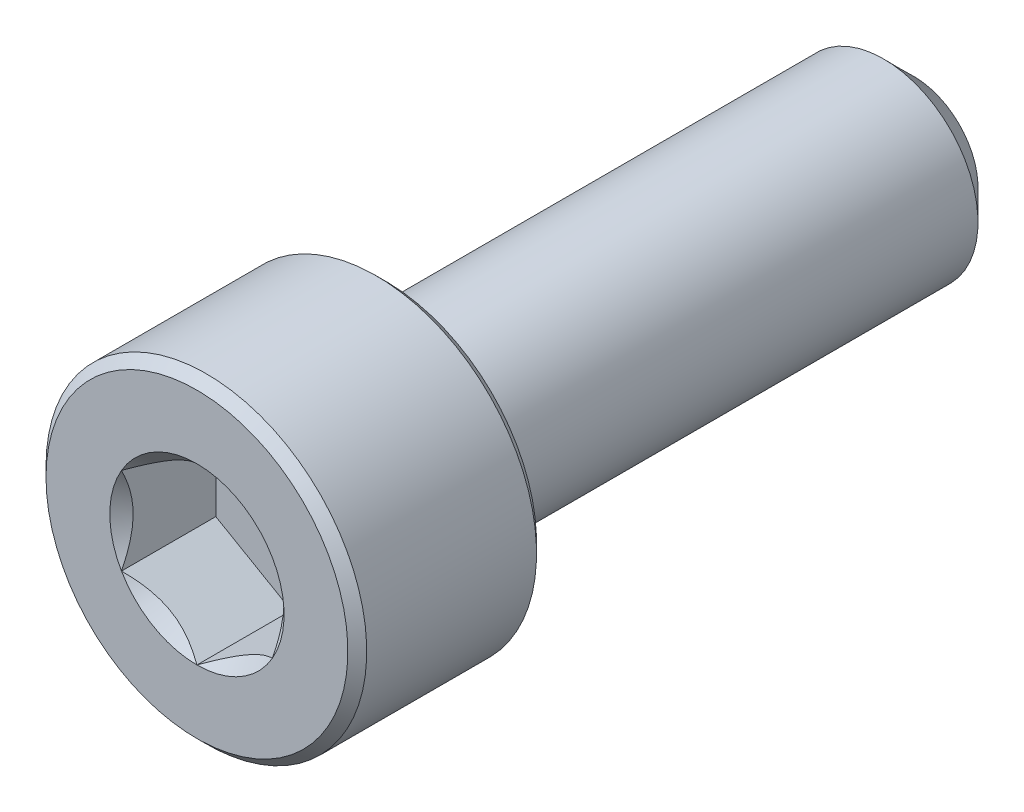
ISO-10303-21;
HEADER;
FILE_DESCRIPTION(('STEP AP214'),'2;1');
FILE_NAME('part.step','',(''),(''),'','','');
FILE_SCHEMA(('AUTOMOTIVE_DESIGN { 1 0 10303 214 1 1 1 1 }'));
ENDSEC;
DATA;
#1=APPLICATION_CONTEXT('core data for automotive mechanical design processes');
#2=APPLICATION_PROTOCOL_DEFINITION('international standard','automotive_design',2000,#1);
#3=PRODUCT_CONTEXT('',#1,'mechanical');
#4=PRODUCT('Part','Part','',(#3));
#5=PRODUCT_RELATED_PRODUCT_CATEGORY('part','',(#4));
#6=PRODUCT_DEFINITION_FORMATION('','',#4);
#7=PRODUCT_DEFINITION_CONTEXT('part definition',#1,'design');
#8=PRODUCT_DEFINITION('design','',#6,#7);
#9=PRODUCT_DEFINITION_SHAPE('','',#8);
#10=(LENGTH_UNIT() NAMED_UNIT(*) SI_UNIT(.MILLI.,.METRE.));
#11=(NAMED_UNIT(*) PLANE_ANGLE_UNIT() SI_UNIT($,.RADIAN.));
#12=(NAMED_UNIT(*) SI_UNIT($,.STERADIAN.) SOLID_ANGLE_UNIT());
#13=UNCERTAINTY_MEASURE_WITH_UNIT(LENGTH_MEASURE(1.E-05),#10,'distance_accuracy_value','');
#14=(GEOMETRIC_REPRESENTATION_CONTEXT(3) GLOBAL_UNCERTAINTY_ASSIGNED_CONTEXT((#13)) GLOBAL_UNIT_ASSIGNED_CONTEXT((#10,
#11,#12)) REPRESENTATION_CONTEXT('',''));
#15=CARTESIAN_POINT('',(0.,0.,0.));
#16=DIRECTION('',(0.,0.,1.));
#17=DIRECTION('',(1.,0.,0.));
#18=AXIS2_PLACEMENT_3D('',#15,#16,#17);
#19=CARTESIAN_POINT('',(0.,4.,9.5));
#20=DIRECTION('',(0.,0.,1.));
#21=DIRECTION('',(1.,0.,0.));
#22=AXIS2_PLACEMENT_3D('',#19,#20,#21);
#23=PLANE('',#22);
#24=CARTESIAN_POINT('',(0.,0.,9.5));
#25=DIRECTION('',(0.,0.,1.));
#26=DIRECTION('',(1.,0.,0.));
#27=AXIS2_PLACEMENT_3D('',#24,#25,#26);
#28=CIRCLE('',#27,2.3094010767585);
#29=CARTESIAN_POINT('',(2.,1.15470053837925,9.5));
#30=VERTEX_POINT('',#29);
#31=CARTESIAN_POINT('',(0.,2.3094010767585,9.5));
#32=VERTEX_POINT('',#31);
#33=EDGE_CURVE('E92',#30,#32,#28,.T.);
#34=ORIENTED_EDGE('',*,*,#33,.F.);
#35=CARTESIAN_POINT('',(2.,-1.15470053837925,9.5));
#36=VERTEX_POINT('',#35);
#37=EDGE_CURVE('E52',#36,#30,#28,.T.);
#38=ORIENTED_EDGE('',*,*,#37,.F.);
#39=CARTESIAN_POINT('',(0.,-2.3094010767585,9.5));
#40=VERTEX_POINT('',#39);
#41=EDGE_CURVE('E278',#40,#36,#28,.T.);
#42=ORIENTED_EDGE('',*,*,#41,.F.);
#43=CARTESIAN_POINT('',(-2.,-1.15470053837925,9.5));
#44=VERTEX_POINT('',#43);
#45=EDGE_CURVE('E59',#44,#40,#28,.T.);
#46=ORIENTED_EDGE('',*,*,#45,.F.);
#47=CARTESIAN_POINT('',(-2.,1.15470053837925,9.5));
#48=VERTEX_POINT('',#47);
#49=EDGE_CURVE('E128',#48,#44,#28,.T.);
#50=ORIENTED_EDGE('',*,*,#49,.F.);
#51=EDGE_CURVE('E101',#32,#48,#28,.T.);
#52=ORIENTED_EDGE('',*,*,#51,.F.);
#53=EDGE_LOOP('',(#34,#38,#42,#46,#50,#52));
#54=FACE_BOUND('',#53,.T.);
#55=CARTESIAN_POINT('',(0.,0.,9.5));
#56=DIRECTION('',(0.,0.,-1.));
#57=DIRECTION('',(-1.,0.,0.));
#58=AXIS2_PLACEMENT_3D('',#55,#56,#57);
#59=CIRCLE('',#58,4.);
#60=CARTESIAN_POINT('',(-4.,0.,9.5));
#61=VERTEX_POINT('',#60);
#62=EDGE_CURVE('E46',#61,#61,#59,.T.);
#63=ORIENTED_EDGE('',*,*,#62,.F.);
#64=EDGE_LOOP('',(#63));
#65=FACE_BOUND('',#64,.T.);
#66=ADVANCED_FACE('F33',(#54,#65),#23,.T.);
#67=CARTESIAN_POINT('',(0.,0.,9.25));
#68=DIRECTION('',(0.,0.,-1.));
#69=DIRECTION('',(-1.,0.,0.));
#70=AXIS2_PLACEMENT_3D('',#67,#68,#69);
#71=CONICAL_SURFACE('',#70,4.25,0.785398163397448);
#72=ORIENTED_EDGE('',*,*,#62,.T.);
#73=EDGE_LOOP('',(#72));
#74=FACE_BOUND('',#73,.T.);
#75=CARTESIAN_POINT('',(0.,0.,9.25));
#76=DIRECTION('',(0.,0.,-1.));
#77=DIRECTION('',(-1.,0.,0.));
#78=AXIS2_PLACEMENT_3D('',#75,#76,#77);
#79=CIRCLE('',#78,4.25);
#80=CARTESIAN_POINT('',(-4.25,0.,9.25));
#81=VERTEX_POINT('',#80);
#82=EDGE_CURVE('E212',#81,#81,#79,.T.);
#83=ORIENTED_EDGE('',*,*,#82,.F.);
#84=EDGE_LOOP('',(#83));
#85=FACE_BOUND('',#84,.T.);
#86=ADVANCED_FACE('F217',(#74,#85),#71,.T.);
#87=CARTESIAN_POINT('',(0.,0.,-9.5));
#88=DIRECTION('',(0.,0.,-1.));
#89=DIRECTION('',(-1.,0.,0.));
#90=AXIS2_PLACEMENT_3D('',#87,#88,#89);
#91=CYLINDRICAL_SURFACE('',#90,4.25);
#92=ORIENTED_EDGE('',*,*,#82,.T.);
#93=EDGE_LOOP('',(#92));
#94=FACE_BOUND('',#93,.T.);
#95=CARTESIAN_POINT('',(0.,0.,4.75));
#96=DIRECTION('',(0.,0.,-1.));
#97=DIRECTION('',(-1.,0.,0.));
#98=AXIS2_PLACEMENT_3D('',#95,#96,#97);
#99=CIRCLE('',#98,4.25);
#100=CARTESIAN_POINT('',(-4.25,0.,4.75));
#101=VERTEX_POINT('',#100);
#102=EDGE_CURVE('E209',#101,#101,#99,.T.);
#103=ORIENTED_EDGE('',*,*,#102,.F.);
#104=EDGE_LOOP('',(#103));
#105=FACE_BOUND('',#104,.T.);
#106=ADVANCED_FACE('F223',(#94,#105),#91,.T.);
#107=CARTESIAN_POINT('',(0.,0.,4.5));
#108=DIRECTION('',(0.,0.,1.));
#109=DIRECTION('',(1.,0.,0.));
#110=AXIS2_PLACEMENT_3D('',#107,#108,#109);
#111=CONICAL_SURFACE('',#110,4.,0.78539816339745);
#112=ORIENTED_EDGE('',*,*,#102,.T.);
#113=EDGE_LOOP('',(#112));
#114=FACE_BOUND('',#113,.T.);
#115=CARTESIAN_POINT('',(0.,0.,4.5));
#116=DIRECTION('',(0.,0.,-1.));
#117=DIRECTION('',(-1.,0.,0.));
#118=AXIS2_PLACEMENT_3D('',#115,#116,#117);
#119=CIRCLE('',#118,4.);
#120=CARTESIAN_POINT('',(-4.,0.,4.5));
#121=VERTEX_POINT('',#120);
#122=EDGE_CURVE('E206',#121,#121,#119,.T.);
#123=ORIENTED_EDGE('',*,*,#122,.F.);
#124=EDGE_LOOP('',(#123));
#125=FACE_BOUND('',#124,.T.);
#126=ADVANCED_FACE('F227',(#114,#125),#111,.T.);
#127=CARTESIAN_POINT('',(0.,4.,4.5));
#128=DIRECTION('',(0.,0.,-1.));
#129=DIRECTION('',(-1.,0.,0.));
#130=AXIS2_PLACEMENT_3D('',#127,#128,#129);
#131=PLANE('',#130);
#132=ORIENTED_EDGE('',*,*,#122,.T.);
#133=EDGE_LOOP('',(#132));
#134=FACE_BOUND('',#133,.T.);
#135=CARTESIAN_POINT('',(0.,0.,4.5));
#136=DIRECTION('',(0.,0.,-1.));
#137=DIRECTION('',(-1.,0.,0.));
#138=AXIS2_PLACEMENT_3D('',#135,#136,#137);
#139=CIRCLE('',#138,2.5);
#140=CARTESIAN_POINT('',(-2.5,0.,4.5));
#141=VERTEX_POINT('',#140);
#142=EDGE_CURVE('E203',#141,#141,#139,.T.);
#143=ORIENTED_EDGE('',*,*,#142,.F.);
#144=EDGE_LOOP('',(#143));
#145=FACE_BOUND('',#144,.T.);
#146=ADVANCED_FACE('F233',(#134,#145),#131,.T.);
#147=CARTESIAN_POINT('',(0.,0.,-9.5));
#148=DIRECTION('',(0.,0.,-1.));
#149=DIRECTION('',(-1.,0.,0.));
#150=AXIS2_PLACEMENT_3D('',#147,#148,#149);
#151=CYLINDRICAL_SURFACE('',#150,2.5);
#152=ORIENTED_EDGE('',*,*,#142,.T.);
#153=EDGE_LOOP('',(#152));
#154=FACE_BOUND('',#153,.T.);
#155=CARTESIAN_POINT('',(0.,0.,-8.69999999999999));
#156=DIRECTION('',(0.,0.,-1.));
#157=DIRECTION('',(-1.,0.,0.));
#158=AXIS2_PLACEMENT_3D('',#155,#156,#157);
#159=CIRCLE('',#158,2.5);
#160=CARTESIAN_POINT('',(-2.5,0.,-8.69999999999999));
#161=VERTEX_POINT('',#160);
#162=EDGE_CURVE('E200',#161,#161,#159,.T.);
#163=ORIENTED_EDGE('',*,*,#162,.F.);
#164=EDGE_LOOP('',(#163));
#165=FACE_BOUND('',#164,.T.);
#166=ADVANCED_FACE('F237',(#154,#165),#151,.T.);
#167=CARTESIAN_POINT('',(0.,0.,-9.5));
#168=DIRECTION('',(0.,0.,1.));
#169=DIRECTION('',(1.,0.,0.));
#170=AXIS2_PLACEMENT_3D('',#167,#168,#169);
#171=CONICAL_SURFACE('',#170,1.7,0.785398163397443);
#172=ORIENTED_EDGE('',*,*,#162,.T.);
#173=EDGE_LOOP('',(#172));
#174=FACE_BOUND('',#173,.T.);
#175=CARTESIAN_POINT('',(0.,0.,-9.5));
#176=DIRECTION('',(0.,0.,-1.));
#177=DIRECTION('',(-1.,0.,0.));
#178=AXIS2_PLACEMENT_3D('',#175,#176,#177);
#179=CIRCLE('',#178,1.7);
#180=CARTESIAN_POINT('',(-1.7,0.,-9.5));
#181=VERTEX_POINT('',#180);
#182=EDGE_CURVE('E188',#181,#181,#179,.T.);
#183=ORIENTED_EDGE('',*,*,#182,.F.);
#184=EDGE_LOOP('',(#183));
#185=FACE_BOUND('',#184,.T.);
#186=ADVANCED_FACE('F240',(#174,#185),#171,.T.);
#187=CARTESIAN_POINT('',(0.,1.7,-9.5));
#188=DIRECTION('',(0.,0.,-1.));
#189=DIRECTION('',(-1.,0.,0.));
#190=AXIS2_PLACEMENT_3D('',#187,#188,#189);
#191=PLANE('',#190);
#192=ORIENTED_EDGE('',*,*,#182,.T.);
#193=EDGE_LOOP('',(#192));
#194=FACE_BOUND('',#193,.T.);
#195=ADVANCED_FACE('F161',(#194),#191,.T.);
#196=CARTESIAN_POINT('',(0.,0.,9.5));
#197=DIRECTION('',(0.,0.,1.));
#198=DIRECTION('',(1.,0.,0.));
#199=AXIS2_PLACEMENT_3D('',#196,#197,#198);
#200=CONICAL_SURFACE('',#199,2.3094010767585,0.78539816339745);
#201=ORIENTED_EDGE('',*,*,#51,.T.);
#202=CARTESIAN_POINT('',(0.000200000000000219,2.30951654681234,9.50011547871366));
#203=CARTESIAN_POINT('',(-0.068553034030705,2.26982196410711,9.46045309022559));
#204=CARTESIAN_POINT('',(-0.138455742135511,2.22946361676572,9.42311998228416));
#205=CARTESIAN_POINT('',(-0.280995244550436,2.14716839667631,9.35476368513614));
#206=CARTESIAN_POINT('',(-0.353645597565358,2.10522369580642,9.32377853373722));
#207=CARTESIAN_POINT('',(-0.500141601053971,2.02064418875706,9.27070021654414));
#208=CARTESIAN_POINT('',(-0.573949935246294,1.97803092714269,9.24847362717661));
#209=CARTESIAN_POINT('',(-0.723191631835264,1.89186619344273,9.21422881667508));
#210=CARTESIAN_POINT('',(-0.798620433918152,1.84831735425552,9.20218502914413));
#211=CARTESIAN_POINT('',(-0.928615500671079,1.7732646674724,9.19131851190557));
#212=CARTESIAN_POINT('',(-0.983013783970109,1.74185780396625,9.18970975360997));
#213=CARTESIAN_POINT('',(-1.09172145551969,1.67909540053412,9.19241887759871));
#214=CARTESIAN_POINT('',(-1.14603080592134,1.64773988246022,9.19673883775797));
#215=CARTESIAN_POINT('',(-1.25413672758934,1.5853248994842,9.21105956740991));
#216=CARTESIAN_POINT('',(-1.30793265655479,1.55426580541469,9.22106669276201));
#217=CARTESIAN_POINT('',(-1.41459426230557,1.49268469862228,9.24621243024966));
#218=CARTESIAN_POINT('',(-1.46746001007071,1.46216264491917,9.26135064904224));
#219=CARTESIAN_POINT('',(-1.60287973308984,1.38397803138049,9.30629450342919));
#220=CARTESIAN_POINT('',(-1.68459383484948,1.33680037273297,9.33948883942582));
#221=CARTESIAN_POINT('',(-1.8047470372578,1.26742988897853,9.39552582317137));
#222=CARTESIAN_POINT('',(-1.84434285210918,1.24456923461531,9.41521470294694));
#223=CARTESIAN_POINT('',(-1.92280095888787,1.19927142554652,9.45638731836487));
#224=CARTESIAN_POINT('',(-1.96166368359374,1.17683402097614,9.47786995165125));
#225=CARTESIAN_POINT('',(-2.0002,1.15458506832541,9.50011547871366));
#226=B_SPLINE_CURVE_WITH_KNOTS('',3,(#202,#203,#204,#205,#206,#207,#208,#209,#210,#211,#212,
#213,#214,#215,#216,#217,#218,#219,#220,#221,#222,#223,#224,#225),.UNSPECIFIED.,.F.,.F.,(4,2,2,
2,2,2,2,2,2,2,2,4),(0.,0.266420613771063,0.534393751523388,0.798110374376914,1.06116288956936,
1.24939906803722,1.43770123566247,1.62621426093932,1.81471283831913,2.11415604834145,
2.26347170717791,2.41269626969771),.UNSPECIFIED.);
#227=EDGE_CURVE('E11',#32,#48,#226,.T.);
#228=ORIENTED_EDGE('',*,*,#227,.F.);
#229=EDGE_LOOP('',(#201,#228));
#230=FACE_BOUND('',#229,.T.);
#231=ADVANCED_FACE('F105',(#230),#200,.F.);
#232=ORIENTED_EDGE('',*,*,#49,.T.);
#233=CARTESIAN_POINT('',(-2.,-2.33350792809314,10.2639129733303));
#234=CARTESIAN_POINT('',(-2.,-2.27682524005105,10.2208846581945));
#235=CARTESIAN_POINT('',(-2.,-2.21982863127677,10.1782632196867));
#236=CARTESIAN_POINT('',(-2.,-2.10508243227164,10.0940173538232));
#237=CARTESIAN_POINT('',(-2.,-2.04733265969732,10.0523931750969));
#238=CARTESIAN_POINT('',(-2.,-1.9305325076875,9.97002893909808));
#239=CARTESIAN_POINT('',(-2.,-1.87147552066419,9.929298220564));
#240=CARTESIAN_POINT('',(-2.,-1.75236453496771,9.84932648957119));
#241=CARTESIAN_POINT('',(-2.,-1.69231060660119,9.81008537269831));
#242=CARTESIAN_POINT('',(-2.,-1.567471533448,9.73116787888498));
#243=CARTESIAN_POINT('',(-2.,-1.50261611656329,9.69160210237478));
#244=CARTESIAN_POINT('',(-2.,-1.37138716901082,9.61502921587276));
#245=CARTESIAN_POINT('',(-2.,-1.30501336962871,9.57802256351504));
#246=CARTESIAN_POINT('',(-2.,-1.17075263037878,9.50736673923406));
#247=CARTESIAN_POINT('',(-2.,-1.10287104348427,9.47370747514608));
#248=CARTESIAN_POINT('',(-2.,-0.96522809254686,9.41049315112672));
#249=CARTESIAN_POINT('',(-2.,-0.895467367515904,9.38093671652697));
#250=CARTESIAN_POINT('',(-2.,-0.760038155655725,9.32931025785436));
#251=CARTESIAN_POINT('',(-2.,-0.694533426178474,9.30681508107925));
#252=CARTESIAN_POINT('',(-2.,-0.561920164972267,9.26707588844303));
#253=CARTESIAN_POINT('',(-2.,-0.494811525645963,9.24983222594905));
#254=CARTESIAN_POINT('',(-2.,-0.360522211095495,9.22179275650282));
#255=CARTESIAN_POINT('',(-2.,-0.293365389163158,9.21088458822734));
#256=CARTESIAN_POINT('',(-2.,-0.158300090029279,9.19573270261191));
#257=CARTESIAN_POINT('',(-2.,-0.0903917516002773,9.19148777487641));
#258=CARTESIAN_POINT('',(-2.,0.0429020652606309,9.1899911421531));
#259=CARTESIAN_POINT('',(-2.,0.108284684169078,9.1924781450741));
#260=CARTESIAN_POINT('',(-2.,0.23850440969295,9.20372439320255));
#261=CARTESIAN_POINT('',(-2.,0.303341463641695,9.21248423709365));
#262=CARTESIAN_POINT('',(-2.,0.433098840648744,9.23594152298035));
#263=CARTESIAN_POINT('',(-2.,0.498000415627631,9.25074108464347));
#264=CARTESIAN_POINT('',(-2.,0.626381661351717,9.2854820388306));
#265=CARTESIAN_POINT('',(-2.,0.689861439952175,9.3054230398874));
#266=CARTESIAN_POINT('',(-2.,0.888345745687483,9.37531214536041));
#267=CARTESIAN_POINT('',(-2.,1.02055912670982,9.43316247106279));
#268=CARTESIAN_POINT('',(-2.,1.27879697777602,9.56182319594991));
#269=CARTESIAN_POINT('',(-2.,1.40479723810912,9.63267988107336));
#270=CARTESIAN_POINT('',(-2.,1.58692013279987,9.74327963632549));
#271=CARTESIAN_POINT('',(-2.,1.64501521895223,9.77983824352554));
#272=CARTESIAN_POINT('',(-2.,1.76020814703229,9.85450591449783));
#273=CARTESIAN_POINT('',(-2.,1.81730591318335,9.8926150953569));
#274=CARTESIAN_POINT('',(-2.,1.93017247334117,9.96978646473081));
#275=CARTESIAN_POINT('',(-2.,1.98594828328331,10.0088384434598));
#276=CARTESIAN_POINT('',(-2.,2.09673667795809,10.0879797964898));
#277=CARTESIAN_POINT('',(-2.,2.15174946854703,10.1280688822828));
#278=CARTESIAN_POINT('',(-2.,2.20644261038877,10.1685829717111));
#279=B_SPLINE_CURVE_WITH_KNOTS('',3,(#233,#234,#235,#236,#237,#238,#239,#240,#241,#242,#243,
#244,#245,#246,#247,#248,#249,#250,#251,#252,#253,#254,#255,#256,#257,#258,#259,#260,#261,#262,
#263,#264,#265,#266,#267,#268,#269,#270,#271,#272,#273,#274,#275,#276,#277,#278),.UNSPECIFIED.,
.F.,.F.,(4,2,2,2,2,2,2,2,2,2,2,2,2,2,2,2,2,2,2,2,2,2,4),(0.,0.213497148294753,0.427046981593394,
0.642249974749849,0.857437855216921,1.08530552050929,1.31321382930987,1.54041273599371,
1.76753533413947,1.97513287362836,2.18274437898411,2.38655158594355,2.59032176649044,
2.78629737352115,2.98229168707252,3.18174703964799,3.38118721025193,3.81287365989454,
4.24612724012855,4.45203046308782,4.65794926316182,4.86220142187746,5.06639735899164),.UNSPECIFIED.);
#280=EDGE_CURVE('E100',#48,#44,#279,.F.);
#281=ORIENTED_EDGE('',*,*,#280,.F.);
#282=EDGE_LOOP('',(#232,#281));
#283=FACE_BOUND('',#282,.T.);
#284=ADVANCED_FACE('F255',(#283),#200,.F.);
#285=ORIENTED_EDGE('',*,*,#45,.T.);
#286=CARTESIAN_POINT('',(-2.0002,-1.15458506832541,9.50011547871366));
#287=CARTESIAN_POINT('',(-1.93144696596929,-1.19427965103065,9.46045309022559));
#288=CARTESIAN_POINT('',(-1.86154425786449,-1.23463799837204,9.42311998228416));
#289=CARTESIAN_POINT('',(-1.71900475544956,-1.31693321846145,9.35476368513614));
#290=CARTESIAN_POINT('',(-1.64635440243464,-1.35887791933134,9.32377853373722));
#291=CARTESIAN_POINT('',(-1.49985839894603,-1.44345742638069,9.27070021654414));
#292=CARTESIAN_POINT('',(-1.42605006475371,-1.48607068799507,9.24847362717661));
#293=CARTESIAN_POINT('',(-1.27680836816474,-1.57223542169503,9.21422881667508));
#294=CARTESIAN_POINT('',(-1.20137956608185,-1.61578426088223,9.20218502914413));
#295=CARTESIAN_POINT('',(-1.07138449932892,-1.69083694766536,9.19131851190557));
#296=CARTESIAN_POINT('',(-1.01698621602989,-1.72224381117151,9.18970975360997));
#297=CARTESIAN_POINT('',(-0.908278544480307,-1.78500621460364,9.19241887759871));
#298=CARTESIAN_POINT('',(-0.853969194078662,-1.81636173267754,9.19673883775797));
#299=CARTESIAN_POINT('',(-0.745863272410663,-1.87877671565355,9.2110595674099));
#300=CARTESIAN_POINT('',(-0.692067343445209,-1.90983580972306,9.22106669276201));
#301=CARTESIAN_POINT('',(-0.585405737694427,-1.97141691651547,9.24621243024966));
#302=CARTESIAN_POINT('',(-0.532539989929288,-2.00193897021859,9.26135064904224));
#303=CARTESIAN_POINT('',(-0.397120266910157,-2.08012358375727,9.30629450342919));
#304=CARTESIAN_POINT('',(-0.315406165150523,-2.12730124240478,9.33948883942582));
#305=CARTESIAN_POINT('',(-0.195252962742199,-2.19667172615922,9.39552582317137));
#306=CARTESIAN_POINT('',(-0.155657147890825,-2.21953238052245,9.41521470294694));
#307=CARTESIAN_POINT('',(-0.0771990411121298,-2.26483018959124,9.45638731836487));
#308=CARTESIAN_POINT('',(-0.0383363164062618,-2.28726759416161,9.47786995165125));
#309=CARTESIAN_POINT('',(0.000199999999997879,-2.30951654681234,9.50011547871366));
#310=B_SPLINE_CURVE_WITH_KNOTS('',3,(#286,#287,#288,#289,#290,#291,#292,#293,#294,#295,#296,
#297,#298,#299,#300,#301,#302,#303,#304,#305,#306,#307,#308,#309),.UNSPECIFIED.,.F.,.F.,(4,2,2,
2,2,2,2,2,2,2,2,4),(0.,0.266420613771064,0.534393751523388,0.798110374376913,1.06116288956936,
1.24939906803722,1.43770123566247,1.62621426093931,1.81471283831913,2.11415604834144,
2.2634717071779,2.4126962696977),.UNSPECIFIED.);
#311=EDGE_CURVE('E137',#44,#40,#310,.T.);
#312=ORIENTED_EDGE('',*,*,#311,.F.);
#313=EDGE_LOOP('',(#285,#312));
#314=FACE_BOUND('',#313,.T.);
#315=ADVANCED_FACE('F259',(#314),#200,.F.);
#316=ORIENTED_EDGE('',*,*,#41,.T.);
#317=CARTESIAN_POINT('',(-0.000200000000001455,-2.30951654681234,9.50011547871366));
#318=CARTESIAN_POINT('',(0.0685530340307044,-2.26982196410711,9.46045309022559));
#319=CARTESIAN_POINT('',(0.138455742135511,-2.22946361676572,9.42311998228416));
#320=CARTESIAN_POINT('',(0.280995244550435,-2.1471683966763,9.35476368513614));
#321=CARTESIAN_POINT('',(0.353645597565357,-2.10522369580642,9.32377853373722));
#322=CARTESIAN_POINT('',(0.50014160105397,-2.02064418875706,9.27070021654414));
#323=CARTESIAN_POINT('',(0.573949935246293,-1.97803092714269,9.24847362717661));
#324=CARTESIAN_POINT('',(0.723191631835263,-1.89186619344273,9.21422881667508));
#325=CARTESIAN_POINT('',(0.798620433918151,-1.84831735425552,9.20218502914413));
#326=CARTESIAN_POINT('',(0.928615500671078,-1.7732646674724,9.19131851190557));
#327=CARTESIAN_POINT('',(0.983013783970108,-1.74185780396625,9.18970975360997));
#328=CARTESIAN_POINT('',(1.09172145551969,-1.67909540053412,9.19241887759871));
#329=CARTESIAN_POINT('',(1.14603080592134,-1.64773988246021,9.19673883775797));
#330=CARTESIAN_POINT('',(1.25413672758934,-1.5853248994842,9.21105956740991));
#331=CARTESIAN_POINT('',(1.30793265655479,-1.55426580541469,9.22106669276201));
#332=CARTESIAN_POINT('',(1.41459426230557,-1.49268469862228,9.24621243024966));
#333=CARTESIAN_POINT('',(1.46746001007071,-1.46216264491917,9.26135064904224));
#334=CARTESIAN_POINT('',(1.60287973308984,-1.38397803138049,9.30629450342919));
#335=CARTESIAN_POINT('',(1.68459383484948,-1.33680037273297,9.33948883942582));
#336=CARTESIAN_POINT('',(1.8047470372578,-1.26742988897853,9.39552582317137));
#337=CARTESIAN_POINT('',(1.84434285210918,-1.24456923461531,9.41521470294694));
#338=CARTESIAN_POINT('',(1.92280095888787,-1.19927142554652,9.45638731836487));
#339=CARTESIAN_POINT('',(1.96166368359374,-1.17683402097614,9.47786995165125));
#340=CARTESIAN_POINT('',(2.0002,-1.15458506832541,9.50011547871366));
#341=B_SPLINE_CURVE_WITH_KNOTS('',3,(#317,#318,#319,#320,#321,#322,#323,#324,#325,#326,#327,
#328,#329,#330,#331,#332,#333,#334,#335,#336,#337,#338,#339,#340),.UNSPECIFIED.,.F.,.F.,(4,2,2,
2,2,2,2,2,2,2,2,4),(0.,0.266420613771064,0.534393751523388,0.798110374376914,1.06116288956936,
1.24939906803722,1.43770123566247,1.62621426093932,1.81471283831913,2.11415604834145,
2.2634717071779,2.41269626969771),.UNSPECIFIED.);
#342=EDGE_CURVE('E280',#40,#36,#341,.T.);
#343=ORIENTED_EDGE('',*,*,#342,.F.);
#344=EDGE_LOOP('',(#316,#343));
#345=FACE_BOUND('',#344,.T.);
#346=ADVANCED_FACE('F268',(#345),#200,.F.);
#347=ORIENTED_EDGE('',*,*,#37,.T.);
#348=CARTESIAN_POINT('',(2.,-2.3335079282084,10.2639129734179));
#349=CARTESIAN_POINT('',(2.,-2.27682524016305,10.2208846582787));
#350=CARTESIAN_POINT('',(2.,-2.21982863138551,10.1782632197674));
#351=CARTESIAN_POINT('',(2.,-2.1050824323738,10.0940173538972));
#352=CARTESIAN_POINT('',(2.,-2.04733265979617,10.0523931751676));
#353=CARTESIAN_POINT('',(2.,-1.93053250777963,9.97002893916205));
#354=CARTESIAN_POINT('',(2.,-1.8714755207529,9.9292982206246));
#355=CARTESIAN_POINT('',(2.,-1.75236453504953,9.84932648962509));
#356=CARTESIAN_POINT('',(2.,-1.69231060667954,9.81008537274889));
#357=CARTESIAN_POINT('',(2.,-1.56747153351884,9.73116787892864));
#358=CARTESIAN_POINT('',(2.,-1.5026161166301,9.69160210241486));
#359=CARTESIAN_POINT('',(2.,-1.37138716906941,9.61502921590585));
#360=CARTESIAN_POINT('',(2.,-1.30501336968313,9.57802256354471));
#361=CARTESIAN_POINT('',(2.,-1.17075263042469,9.50736673925719));
#362=CARTESIAN_POINT('',(2.,-1.10287104352586,9.47370747516608));
#363=CARTESIAN_POINT('',(2.,-0.965228092579558,9.41049315114084));
#364=CARTESIAN_POINT('',(2.,-0.895467367544042,9.38093671653835));
#365=CARTESIAN_POINT('',(2.,-0.760038155681911,9.32931025786374));
#366=CARTESIAN_POINT('',(2.,-0.694533426207471,9.30681508108886));
#367=CARTESIAN_POINT('',(2.,-0.561920165006982,9.26707588845251));
#368=CARTESIAN_POINT('',(2.,-0.494811525683585,9.24983222595819));
#369=CARTESIAN_POINT('',(2.,-0.360522211138837,9.22179275651061));
#370=CARTESIAN_POINT('',(2.,-0.293365389209313,9.21088458823414));
#371=CARTESIAN_POINT('',(2.,-0.15830009008097,9.19573270261609));
#372=CARTESIAN_POINT('',(2.,-0.0903917516546917,9.19148777487896));
#373=CARTESIAN_POINT('',(2.,0.0429020652013076,9.18999114215191));
#374=CARTESIAN_POINT('',(2.,0.108284684107563,9.19247814507083));
#375=CARTESIAN_POINT('',(2.,0.238504409627276,9.20372439319483));
#376=CARTESIAN_POINT('',(2.,0.303341463574056,9.21248423708354));
#377=CARTESIAN_POINT('',(2.,0.433098840577223,9.23594152296526));
#378=CARTESIAN_POINT('',(2.,0.498000415554201,9.25074108462575));
#379=CARTESIAN_POINT('',(2.,0.626381661274659,9.2854820388076));
#380=CARTESIAN_POINT('',(2.,0.689861439873398,9.30542303986172));
#381=CARTESIAN_POINT('',(2.,0.888345745591677,9.3753121453222));
#382=CARTESIAN_POINT('',(2.,1.02055912659956,9.43316247101307));
#383=CARTESIAN_POINT('',(2.,1.27879697763796,9.56182319587588));
#384=CARTESIAN_POINT('',(2.,1.40479723795773,9.63267988098653));
#385=CARTESIAN_POINT('',(2.,1.58692013262996,9.74327963621991));
#386=CARTESIAN_POINT('',(2.,1.64501521877692,9.77983824341419));
#387=CARTESIAN_POINT('',(2.,1.76020814684622,9.85450591437492));
#388=CARTESIAN_POINT('',(2.,1.81730591299196,9.8926150952282));
#389=CARTESIAN_POINT('',(2.,1.93017247313923,9.96978646459059));
#390=CARTESIAN_POINT('',(2.,1.98594828307617,10.0088384433139));
#391=CARTESIAN_POINT('',(2.,2.09673667774057,10.0879797963324));
#392=CARTESIAN_POINT('',(2.,2.15174946832435,10.1280688821197));
#393=CARTESIAN_POINT('',(2.,2.20644261016092,10.1685829715422));
#394=B_SPLINE_CURVE_WITH_KNOTS('',3,(#348,#349,#350,#351,#352,#353,#354,#355,#356,#357,#358,
#359,#360,#361,#362,#363,#364,#365,#366,#367,#368,#369,#370,#371,#372,#373,#374,#375,#376,#377,
#378,#379,#380,#381,#382,#383,#384,#385,#386,#387,#388,#389,#390,#391,#392,#393),.UNSPECIFIED.,
.F.,.F.,(4,2,2,2,2,2,2,2,2,2,2,2,2,2,2,2,2,2,2,2,2,2,4),(0.,0.213497148308672,0.427046981621236,
0.642249974791875,0.85743785527313,1.08530552058142,1.31321382939793,1.54041273609756,
1.76753533425909,1.97513287373982,2.18274437908743,2.38655158603907,2.59032176657815,
2.78629737360208,2.98229168714667,3.18174703971481,3.38118721031143,3.81287365990069,
4.24612724008101,4.45203046301732,4.65794926306836,4.86220142176135,5.06639735885289),.UNSPECIFIED.);
#395=EDGE_CURVE('E117',#36,#30,#394,.T.);
#396=ORIENTED_EDGE('',*,*,#395,.F.);
#397=EDGE_LOOP('',(#347,#396));
#398=FACE_BOUND('',#397,.T.);
#399=ADVANCED_FACE('F262',(#398),#200,.F.);
#400=ORIENTED_EDGE('',*,*,#33,.T.);
#401=CARTESIAN_POINT('',(2.0002,1.15458506832542,9.50011547871366));
#402=CARTESIAN_POINT('',(1.93144696596929,1.19427965103065,9.46045309022559));
#403=CARTESIAN_POINT('',(1.86154425786449,1.23463799837204,9.42311998228416));
#404=CARTESIAN_POINT('',(1.71900475544956,1.31693321846145,9.35476368513614));
#405=CARTESIAN_POINT('',(1.64635440243464,1.35887791933134,9.32377853373722));
#406=CARTESIAN_POINT('',(1.49985839894603,1.44345742638069,9.27070021654414));
#407=CARTESIAN_POINT('',(1.42605006475371,1.48607068799507,9.24847362717661));
#408=CARTESIAN_POINT('',(1.27680836816474,1.57223542169503,9.21422881667508));
#409=CARTESIAN_POINT('',(1.20137956608185,1.61578426088223,9.20218502914413));
#410=CARTESIAN_POINT('',(1.07138449932892,1.69083694766536,9.19131851190557));
#411=CARTESIAN_POINT('',(1.01698621602989,1.72224381117151,9.18970975360997));
#412=CARTESIAN_POINT('',(0.908278544480307,1.78500621460364,9.19241887759871));
#413=CARTESIAN_POINT('',(0.853969194078662,1.81636173267754,9.19673883775797));
#414=CARTESIAN_POINT('',(0.745863272410663,1.87877671565355,9.2110595674099));
#415=CARTESIAN_POINT('',(0.692067343445209,1.90983580972306,9.22106669276201));
#416=CARTESIAN_POINT('',(0.585405737694427,1.97141691651547,9.24621243024966));
#417=CARTESIAN_POINT('',(0.532539989929288,2.00193897021859,9.26135064904224));
#418=CARTESIAN_POINT('',(0.397120266910156,2.08012358375727,9.30629450342919));
#419=CARTESIAN_POINT('',(0.315406165150522,2.12730124240478,9.33948883942582));
#420=CARTESIAN_POINT('',(0.195252962742198,2.19667172615922,9.39552582317137));
#421=CARTESIAN_POINT('',(0.155657147890823,2.21953238052245,9.41521470294694));
#422=CARTESIAN_POINT('',(0.0771990411121272,2.26483018959124,9.45638731836487));
#423=CARTESIAN_POINT('',(0.0383363164062592,2.28726759416161,9.47786995165125));
#424=CARTESIAN_POINT('',(-0.000200000000000176,2.30951654681234,9.50011547871366));
#425=B_SPLINE_CURVE_WITH_KNOTS('',3,(#401,#402,#403,#404,#405,#406,#407,#408,#409,#410,#411,
#412,#413,#414,#415,#416,#417,#418,#419,#420,#421,#422,#423,#424),.UNSPECIFIED.,.F.,.F.,(4,2,2,
2,2,2,2,2,2,2,2,4),(0.,0.266420613771063,0.534393751523387,0.798110374376912,1.06116288956936,
1.24939906803721,1.43770123566247,1.62621426093931,1.81471283831913,2.11415604834144,
2.2634717071779,2.41269626969771),.UNSPECIFIED.);
#426=EDGE_CURVE('E96',#30,#32,#425,.T.);
#427=ORIENTED_EDGE('',*,*,#426,.F.);
#428=EDGE_LOOP('',(#400,#427));
#429=FACE_BOUND('',#428,.T.);
#430=ADVANCED_FACE('F94',(#429),#200,.F.);
#431=CARTESIAN_POINT('',(0.,0.,7.));
#432=DIRECTION('',(0.,0.,1.));
#433=DIRECTION('',(1.,0.,0.));
#434=AXIS2_PLACEMENT_3D('',#431,#432,#433);
#435=PLANE('',#434);
#436=DIRECTION('',(-0.866025403784439,0.5,0.));
#437=VECTOR('',#436,1.);
#438=CARTESIAN_POINT('',(2.,1.15470053837925,7.));
#439=LINE('',#438,#437);
#440=CARTESIAN_POINT('',(2.,1.15470053837925,7.));
#441=VERTEX_POINT('',#440);
#442=CARTESIAN_POINT('',(0.,2.3094010767585,7.));
#443=VERTEX_POINT('',#442);
#444=EDGE_CURVE('E116',#441,#443,#439,.T.);
#445=ORIENTED_EDGE('',*,*,#444,.T.);
#446=DIRECTION('',(-0.866025403784439,-0.5,0.));
#447=VECTOR('',#446,1.);
#448=CARTESIAN_POINT('',(0.,2.3094010767585,7.));
#449=LINE('',#448,#447);
#450=CARTESIAN_POINT('',(-2.,1.15470053837925,7.));
#451=VERTEX_POINT('',#450);
#452=EDGE_CURVE('E121',#443,#451,#449,.T.);
#453=ORIENTED_EDGE('',*,*,#452,.T.);
#454=DIRECTION('',(0.,-1.,0.));
#455=VECTOR('',#454,1.);
#456=CARTESIAN_POINT('',(-2.,1.15470053837925,7.));
#457=LINE('',#456,#455);
#458=CARTESIAN_POINT('',(-2.,-1.15470053837925,7.));
#459=VERTEX_POINT('',#458);
#460=EDGE_CURVE('E176',#451,#459,#457,.T.);
#461=ORIENTED_EDGE('',*,*,#460,.T.);
#462=DIRECTION('',(0.866025403784439,-0.5,0.));
#463=VECTOR('',#462,1.);
#464=CARTESIAN_POINT('',(-2.,-1.15470053837925,7.));
#465=LINE('',#464,#463);
#466=CARTESIAN_POINT('',(0.,-2.3094010767585,7.));
#467=VERTEX_POINT('',#466);
#468=EDGE_CURVE('E179',#459,#467,#465,.T.);
#469=ORIENTED_EDGE('',*,*,#468,.T.);
#470=DIRECTION('',(0.866025403784439,0.5,0.));
#471=VECTOR('',#470,1.);
#472=CARTESIAN_POINT('',(0.,-2.3094010767585,7.));
#473=LINE('',#472,#471);
#474=CARTESIAN_POINT('',(2.,-1.15470053837925,7.));
#475=VERTEX_POINT('',#474);
#476=EDGE_CURVE('E182',#467,#475,#473,.T.);
#477=ORIENTED_EDGE('',*,*,#476,.T.);
#478=DIRECTION('',(0.,1.,0.));
#479=VECTOR('',#478,1.);
#480=CARTESIAN_POINT('',(2.,-1.15470053837925,7.));
#481=LINE('',#480,#479);
#482=EDGE_CURVE('E124',#475,#441,#481,.T.);
#483=ORIENTED_EDGE('',*,*,#482,.T.);
#484=EDGE_LOOP('',(#445,#453,#461,#469,#477,#483));
#485=FACE_BOUND('',#484,.T.);
#486=ADVANCED_FACE('F156',(#485),#435,.T.);
#487=CARTESIAN_POINT('',(0.,2.3094010767585,7.));
#488=DIRECTION('',(-0.5,0.866025403784439,0.));
#489=DIRECTION('',(-0.866025403784439,-0.5,0.));
#490=AXIS2_PLACEMENT_3D('',#487,#488,#489);
#491=PLANE('',#490);
#492=DIRECTION('',(0.,0.,1.));
#493=VECTOR('',#492,1.);
#494=CARTESIAN_POINT('',(0.,2.3094010767585,7.));
#495=LINE('',#494,#493);
#496=EDGE_CURVE('E113',#443,#32,#495,.T.);
#497=ORIENTED_EDGE('',*,*,#496,.T.);
#498=ORIENTED_EDGE('',*,*,#227,.T.);
#499=DIRECTION('',(0.,0.,1.));
#500=VECTOR('',#499,1.);
#501=CARTESIAN_POINT('',(-2.,1.15470053837925,7.));
#502=LINE('',#501,#500);
#503=EDGE_CURVE('E123',#451,#48,#502,.T.);
#504=ORIENTED_EDGE('',*,*,#503,.F.);
#505=ORIENTED_EDGE('',*,*,#452,.F.);
#506=EDGE_LOOP('',(#497,#498,#504,#505));
#507=FACE_BOUND('',#506,.T.);
#508=ADVANCED_FACE('F119',(#507),#491,.F.);
#509=CARTESIAN_POINT('',(-2.,1.15470053837925,7.));
#510=DIRECTION('',(-1.,0.,0.));
#511=DIRECTION('',(0.,-1.,0.));
#512=AXIS2_PLACEMENT_3D('',#509,#510,#511);
#513=PLANE('',#512);
#514=ORIENTED_EDGE('',*,*,#503,.T.);
#515=ORIENTED_EDGE('',*,*,#280,.T.);
#516=DIRECTION('',(0.,0.,1.));
#517=VECTOR('',#516,1.);
#518=CARTESIAN_POINT('',(-2.,-1.15470053837925,7.));
#519=LINE('',#518,#517);
#520=EDGE_CURVE('E194',#459,#44,#519,.T.);
#521=ORIENTED_EDGE('',*,*,#520,.F.);
#522=ORIENTED_EDGE('',*,*,#460,.F.);
#523=EDGE_LOOP('',(#514,#515,#521,#522));
#524=FACE_BOUND('',#523,.T.);
#525=ADVANCED_FACE('F146',(#524),#513,.F.);
#526=CARTESIAN_POINT('',(-2.,-1.15470053837925,7.));
#527=DIRECTION('',(-0.5,-0.866025403784438,0.));
#528=DIRECTION('',(0.866025403784439,-0.5,0.));
#529=AXIS2_PLACEMENT_3D('',#526,#527,#528);
#530=PLANE('',#529);
#531=ORIENTED_EDGE('',*,*,#520,.T.);
#532=ORIENTED_EDGE('',*,*,#311,.T.);
#533=DIRECTION('',(0.,0.,1.));
#534=VECTOR('',#533,1.);
#535=CARTESIAN_POINT('',(0.,-2.3094010767585,7.));
#536=LINE('',#535,#534);
#537=EDGE_CURVE('E191',#467,#40,#536,.T.);
#538=ORIENTED_EDGE('',*,*,#537,.F.);
#539=ORIENTED_EDGE('',*,*,#468,.F.);
#540=EDGE_LOOP('',(#531,#532,#538,#539));
#541=FACE_BOUND('',#540,.T.);
#542=ADVANCED_FACE('F149',(#541),#530,.F.);
#543=CARTESIAN_POINT('',(0.,-2.3094010767585,7.));
#544=DIRECTION('',(0.5,-0.866025403784439,0.));
#545=DIRECTION('',(0.866025403784439,0.5,0.));
#546=AXIS2_PLACEMENT_3D('',#543,#544,#545);
#547=PLANE('',#546);
#548=ORIENTED_EDGE('',*,*,#537,.T.);
#549=ORIENTED_EDGE('',*,*,#342,.T.);
#550=DIRECTION('',(0.,0.,1.));
#551=VECTOR('',#550,1.);
#552=CARTESIAN_POINT('',(2.,-1.15470053837925,7.));
#553=LINE('',#552,#551);
#554=EDGE_CURVE('E189',#475,#36,#553,.T.);
#555=ORIENTED_EDGE('',*,*,#554,.F.);
#556=ORIENTED_EDGE('',*,*,#476,.F.);
#557=EDGE_LOOP('',(#548,#549,#555,#556));
#558=FACE_BOUND('',#557,.T.);
#559=ADVANCED_FACE('F286',(#558),#547,.F.);
#560=CARTESIAN_POINT('',(2.,-1.15470053837925,7.));
#561=DIRECTION('',(1.,0.,0.));
#562=DIRECTION('',(0.,1.,0.));
#563=AXIS2_PLACEMENT_3D('',#560,#561,#562);
#564=PLANE('',#563);
#565=ORIENTED_EDGE('',*,*,#554,.T.);
#566=ORIENTED_EDGE('',*,*,#395,.T.);
#567=DIRECTION('',(0.,0.,1.));
#568=VECTOR('',#567,1.);
#569=CARTESIAN_POINT('',(2.,1.15470053837925,7.));
#570=LINE('',#569,#568);
#571=EDGE_CURVE('E115',#441,#30,#570,.T.);
#572=ORIENTED_EDGE('',*,*,#571,.F.);
#573=ORIENTED_EDGE('',*,*,#482,.F.);
#574=EDGE_LOOP('',(#565,#566,#572,#573));
#575=FACE_BOUND('',#574,.T.);
#576=ADVANCED_FACE('F160',(#575),#564,.F.);
#577=CARTESIAN_POINT('',(2.,1.15470053837925,7.));
#578=DIRECTION('',(0.5,0.866025403784439,0.));
#579=DIRECTION('',(-0.866025403784439,0.5,0.));
#580=AXIS2_PLACEMENT_3D('',#577,#578,#579);
#581=PLANE('',#580);
#582=ORIENTED_EDGE('',*,*,#571,.T.);
#583=ORIENTED_EDGE('',*,*,#426,.T.);
#584=ORIENTED_EDGE('',*,*,#496,.F.);
#585=ORIENTED_EDGE('',*,*,#444,.F.);
#586=EDGE_LOOP('',(#582,#583,#584,#585));
#587=FACE_BOUND('',#586,.T.);
#588=ADVANCED_FACE('F111',(#587),#581,.F.);
#589=CLOSED_SHELL('',(#66,#86,#106,#126,#146,#166,#186,#195,#231,#284,#315,#346,#399,#430,#486,
#508,#525,#542,#559,#576,#588));
#590=MANIFOLD_SOLID_BREP('B2',#589);
#591=ADVANCED_BREP_SHAPE_REPRESENTATION('',(#18,#590),#14);
#592=SHAPE_DEFINITION_REPRESENTATION(#9,#591);
ENDSEC;
END-ISO-10303-21;
